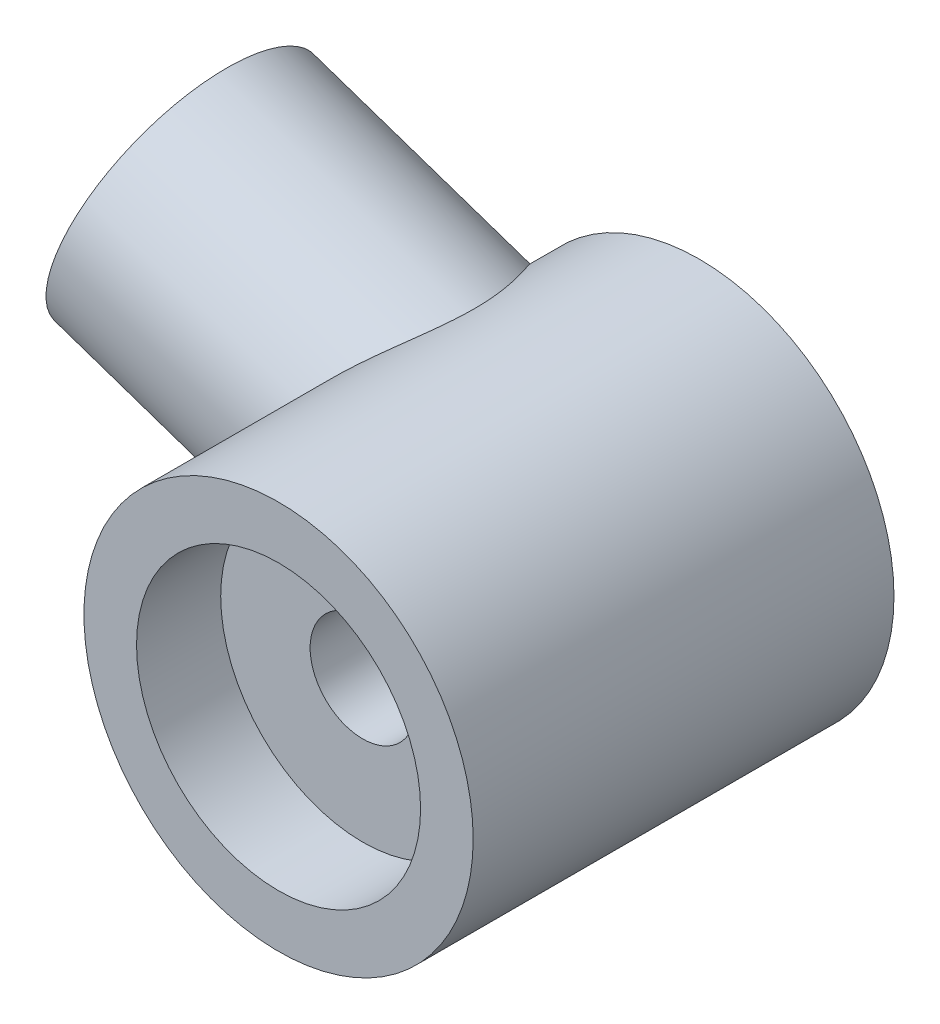
ISO-10303-21;
HEADER;
FILE_DESCRIPTION(('STEP AP214'),'2;1');
FILE_NAME('part.step','',(''),(''),'','','');
FILE_SCHEMA(('AUTOMOTIVE_DESIGN { 1 0 10303 214 1 1 1 1 }'));
ENDSEC;
DATA;
#1=APPLICATION_CONTEXT('core data for automotive mechanical design processes');
#2=APPLICATION_PROTOCOL_DEFINITION('international standard','automotive_design',2000,#1);
#3=PRODUCT_CONTEXT('',#1,'mechanical');
#4=PRODUCT('Part','Part','',(#3));
#5=PRODUCT_RELATED_PRODUCT_CATEGORY('part','',(#4));
#6=PRODUCT_DEFINITION_FORMATION('','',#4);
#7=PRODUCT_DEFINITION_CONTEXT('part definition',#1,'design');
#8=PRODUCT_DEFINITION('design','',#6,#7);
#9=PRODUCT_DEFINITION_SHAPE('','',#8);
#10=(LENGTH_UNIT() NAMED_UNIT(*) SI_UNIT(.MILLI.,.METRE.));
#11=(NAMED_UNIT(*) PLANE_ANGLE_UNIT() SI_UNIT($,.RADIAN.));
#12=(NAMED_UNIT(*) SI_UNIT($,.STERADIAN.) SOLID_ANGLE_UNIT());
#13=UNCERTAINTY_MEASURE_WITH_UNIT(LENGTH_MEASURE(1.E-05),#10,'distance_accuracy_value','');
#14=(GEOMETRIC_REPRESENTATION_CONTEXT(3) GLOBAL_UNCERTAINTY_ASSIGNED_CONTEXT((#13)) GLOBAL_UNIT_ASSIGNED_CONTEXT((#10,
#11,#12)) REPRESENTATION_CONTEXT('',''));
#15=CARTESIAN_POINT('',(0.,0.,0.));
#16=DIRECTION('',(0.,0.,1.));
#17=DIRECTION('',(1.,0.,0.));
#18=AXIS2_PLACEMENT_3D('',#15,#16,#17);
#19=CARTESIAN_POINT('',(51.0812570126981,-10.9818900663506,25.));
#20=DIRECTION('',(0.,0.,1.));
#21=DIRECTION('',(1.,0.,0.));
#22=AXIS2_PLACEMENT_3D('',#19,#20,#21);
#23=CYLINDRICAL_SURFACE('',#22,18.5);
#24=CARTESIAN_POINT('',(51.0812570126981,-10.9818900663506,40.));
#25=DIRECTION('',(0.,0.,1.));
#26=DIRECTION('',(1.,0.,0.));
#27=AXIS2_PLACEMENT_3D('',#24,#25,#26);
#28=CIRCLE('',#27,18.5);
#29=CARTESIAN_POINT('',(69.5812570126981,-10.9818900663506,40.));
#30=VERTEX_POINT('',#29);
#31=EDGE_CURVE('E11',#30,#30,#28,.T.);
#32=ORIENTED_EDGE('',*,*,#31,.F.);
#33=EDGE_LOOP('',(#32));
#34=FACE_BOUND('',#33,.T.);
#35=CARTESIAN_POINT('',(51.0812570126981,-10.9818900663506,0.));
#36=DIRECTION('',(0.,0.,-1.));
#37=DIRECTION('',(-1.,0.,0.));
#38=AXIS2_PLACEMENT_3D('',#35,#36,#37);
#39=CIRCLE('',#38,18.5);
#40=CARTESIAN_POINT('',(33.5682457005577,-5.01997470458624,0.));
#41=VERTEX_POINT('',#40);
#42=EDGE_CURVE('E64',#41,#41,#39,.T.);
#43=ORIENTED_EDGE('',*,*,#42,.F.);
#44=CARTESIAN_POINT('',(42.1990035903044,5.24634379135472,12.5));
#45=CARTESIAN_POINT('',(42.1990004703523,5.24634318109895,12.8038051601148));
#46=CARTESIAN_POINT('',(42.1857730097204,5.23912353675234,13.107631072088));
#47=CARTESIAN_POINT('',(42.133441284413,5.21031361647367,13.7123582731616));
#48=CARTESIAN_POINT('',(42.0943339456624,5.1887216333584,14.0132592105174));
#49=CARTESIAN_POINT('',(41.9918043604203,5.13131214730716,14.609956738981));
#50=CARTESIAN_POINT('',(41.928344197281,5.0954724579592,14.9057446149086));
#51=CARTESIAN_POINT('',(41.7795023831543,5.00981739119636,15.4896378095039));
#52=CARTESIAN_POINT('',(41.6941200263972,4.96000156382472,15.7777428804994));
#53=CARTESIAN_POINT('',(41.505192162109,4.84722675183263,16.341792525707));
#54=CARTESIAN_POINT('',(41.401844507353,4.78440964575624,16.6178323212905));
#55=CARTESIAN_POINT('',(41.1790966966357,4.64547209518702,17.160018605195));
#56=CARTESIAN_POINT('',(41.059689084152,4.56934546622535,17.4261604242459));
#57=CARTESIAN_POINT('',(40.8075089757295,4.40390964786538,17.94773864138));
#58=CARTESIAN_POINT('',(40.6747375251603,4.3146014893215,18.2031758746058));
#59=CARTESIAN_POINT('',(40.3983007345399,4.12283565512731,18.7028391918628));
#60=CARTESIAN_POINT('',(40.2546384383659,4.02038164810035,18.9470683780144));
#61=CARTESIAN_POINT('',(39.9347647546439,3.78466874224764,19.4624351998478));
#62=CARTESIAN_POINT('',(39.7570354164152,3.64910574109572,19.7315797825207));
#63=CARTESIAN_POINT('',(39.3929379877913,3.35991126702616,20.2538430568364));
#64=CARTESIAN_POINT('',(39.2065692856179,3.20627851334931,20.506960610547));
#65=CARTESIAN_POINT('',(38.8278162899417,2.88049246383237,20.9967660695289));
#66=CARTESIAN_POINT('',(38.6354258410273,2.70831974674971,21.2334363103187));
#67=CARTESIAN_POINT('',(38.2474508912658,2.34530077887374,21.6892171598095));
#68=CARTESIAN_POINT('',(38.0518661916284,2.15445336216518,21.908326670588));
#69=CARTESIAN_POINT('',(37.6304861286932,1.72364742160668,22.3595712664004));
#70=CARTESIAN_POINT('',(37.4045796754574,1.48062204330665,22.5886935297251));
#71=CARTESIAN_POINT('',(36.955663316049,0.969399767957076,23.020346211576));
#72=CARTESIAN_POINT('',(36.7326538990567,0.701198681161049,23.2228721904412));
#73=CARTESIAN_POINT('',(36.2937420308165,0.140428935847601,23.5986931703859));
#74=CARTESIAN_POINT('',(36.0778294124713,-0.1521025349366,23.7720315996849));
#75=CARTESIAN_POINT('',(35.6567188513685,-0.760813013796165,24.0872602672865));
#76=CARTESIAN_POINT('',(35.4515166948199,-1.07698260106889,24.2291629456639));
#77=CARTESIAN_POINT('',(35.1059919863478,-1.64795667266524,24.4472727621351));
#78=CARTESIAN_POINT('',(34.9624281044301,-1.89795174365488,24.5310116931952));
#79=CARTESIAN_POINT('',(34.6849654883009,-2.4089050083029,24.6786402183588));
#80=CARTESIAN_POINT('',(34.55106484009,-2.66986101463653,24.742533751575));
#81=CARTESIAN_POINT('',(34.2944436951149,-3.20115225754367,24.8496294613466));
#82=CARTESIAN_POINT('',(34.171716514209,-3.47148175129909,24.8928440750902));
#83=CARTESIAN_POINT('',(33.9386192071013,-4.0199401510982,24.9580462979628));
#84=CARTESIAN_POINT('',(33.8282494883836,-4.29806931395598,24.980033207296));
#85=CARTESIAN_POINT('',(33.620734912726,-4.86060007086968,25.002477344692));
#86=CARTESIAN_POINT('',(33.5236123078713,-5.14501130865481,25.0028987813528));
#87=CARTESIAN_POINT('',(33.3435489465844,-5.71750435665996,24.9821156976444));
#88=CARTESIAN_POINT('',(33.2606081376334,-6.00558615328274,24.9609112573632));
#89=CARTESIAN_POINT('',(33.109295621336,-6.58327796022762,24.8971768235056));
#90=CARTESIAN_POINT('',(33.0409274761617,-6.87288832650803,24.8546416242939));
#91=CARTESIAN_POINT('',(32.9188506174996,-7.45139502582299,24.7488335135752));
#92=CARTESIAN_POINT('',(32.8651419598402,-7.74029135613409,24.6855605230934));
#93=CARTESIAN_POINT('',(32.7729551502358,-8.31019905941583,24.5403991003049));
#94=CARTESIAN_POINT('',(32.734223037363,-8.59125927321445,24.4588618743987));
#95=CARTESIAN_POINT('',(32.6701439755172,-9.14894083703371,24.2774927808327));
#96=CARTESIAN_POINT('',(32.644796776859,-9.42556226976306,24.1776612544858));
#97=CARTESIAN_POINT('',(32.6067632161282,-9.97277980646673,23.9607086488563));
#98=CARTESIAN_POINT('',(32.5940757192983,-10.2433764483494,23.843589120271));
#99=CARTESIAN_POINT('',(32.5804598515267,-10.7772971877118,23.5930242719745));
#100=CARTESIAN_POINT('',(32.5795357424608,-11.0406186149067,23.4595730529691));
#101=CARTESIAN_POINT('',(32.5889381217991,-11.5878719497218,23.1614686464702));
#102=CARTESIAN_POINT('',(32.6005419152557,-11.8707901541548,22.9949942380252));
#103=CARTESIAN_POINT('',(32.6355142982015,-12.4246660857671,22.6443124698185));
#104=CARTESIAN_POINT('',(32.6588843826329,-12.6956222883793,22.4601028591525));
#105=CARTESIAN_POINT('',(32.7157722131161,-13.2246140689719,22.0748342075059));
#106=CARTESIAN_POINT('',(32.7493013576305,-13.4826347523425,21.8737564246489));
#107=CARTESIAN_POINT('',(32.8247426203512,-13.9842226638357,21.4559038323097));
#108=CARTESIAN_POINT('',(32.8666530561845,-14.227792779912,21.2391321786138));
#109=CARTESIAN_POINT('',(32.9646162358307,-14.7390059948362,20.7529485339722));
#110=CARTESIAN_POINT('',(33.021861990995,-15.0038322055367,20.4808064612039));
#111=CARTESIAN_POINT('',(33.1421946731552,-15.5104489431421,19.9169687297742));
#112=CARTESIAN_POINT('',(33.2052827596981,-15.7522348777623,19.625269192662));
#113=CARTESIAN_POINT('',(33.3338895266827,-16.210421359651,19.0232265504769));
#114=CARTESIAN_POINT('',(33.3994072409654,-16.4268318581409,18.7128908264484));
#115=CARTESIAN_POINT('',(33.5291889964054,-16.8316832124894,18.0742651151403));
#116=CARTESIAN_POINT('',(33.5934534317942,-17.0201329910775,17.745980901484));
#117=CARTESIAN_POINT('',(33.7020674896346,-17.3248697442034,17.1524335779718));
#118=CARTESIAN_POINT('',(33.747523537697,-17.4476682102908,16.8907064551427));
#119=CARTESIAN_POINT('',(33.8334733552347,-17.6735688507567,16.3581199787276));
#120=CARTESIAN_POINT('',(33.8739683869524,-17.7766760389775,16.087262970536));
#121=CARTESIAN_POINT('',(33.948063895617,-17.9614031197094,15.537813801551));
#122=CARTESIAN_POINT('',(33.9816745044429,-18.043054639594,15.2592337030365));
#123=CARTESIAN_POINT('',(34.0403221676983,-18.1834417443456,14.695433100566));
#124=CARTESIAN_POINT('',(34.0653592996475,-18.2421775364126,14.4102126566755));
#125=CARTESIAN_POINT('',(34.1055773057452,-18.3357281271418,13.8327589435191));
#126=CARTESIAN_POINT('',(34.1206763201503,-18.3703443877491,13.5404874951778));
#127=CARTESIAN_POINT('',(34.1397368400603,-18.4139471059357,12.9536650568986));
#128=CARTESIAN_POINT('',(34.1436985481368,-18.4229340296756,12.6591141085192));
#129=CARTESIAN_POINT('',(34.1402259731571,-18.4150241714813,12.0704146456311));
#130=CARTESIAN_POINT('',(34.1327910199503,-18.3981258674347,11.7762661558058));
#131=CARTESIAN_POINT('',(34.1070065775937,-18.3389176229889,11.1910465767764));
#132=CARTESIAN_POINT('',(34.0886572923969,-18.2966081574406,10.8999754301703));
#133=CARTESIAN_POINT('',(34.0447310202563,-18.1936531078051,10.3548525184684));
#134=CARTESIAN_POINT('',(34.0201657540057,-18.1355233043021,10.1002378001727));
#135=CARTESIAN_POINT('',(33.9644060803802,-18.0010571022619,9.59657115137172));
#136=CARTESIAN_POINT('',(33.9332092502887,-17.9247140486079,9.34752129072921));
#137=CARTESIAN_POINT('',(33.8315561766194,-17.6700331360671,8.61012068469348));
#138=CARTESIAN_POINT('',(33.7530367332774,-17.4660421750308,8.13151201990254));
#139=CARTESIAN_POINT('',(33.6086315087869,-17.0637957911613,7.33375551004699));
#140=CARTESIAN_POINT('',(33.5452061054282,-16.8793780704197,7.00693918067331));
#141=CARTESIAN_POINT('',(33.4167755331285,-16.4827580702371,6.370731092665));
#142=CARTESIAN_POINT('',(33.3517697904605,-16.270545573693,6.06134580162289));
#143=CARTESIAN_POINT('',(33.2237458140137,-15.8206993725207,5.46050075813813));
#144=CARTESIAN_POINT('',(33.1607308790668,-15.5830260740534,5.16907006839446));
#145=CARTESIAN_POINT('',(33.0401298854157,-15.0847470935712,4.60538322365396));
#146=CARTESIAN_POINT('',(32.9825432402237,-14.8241438948637,4.33312499801551));
#147=CARTESIAN_POINT('',(32.8751473235017,-14.2782500518727,3.80513122231914));
#148=CARTESIAN_POINT('',(32.8254524520651,-13.9926756879782,3.54966556169267));
#149=CARTESIAN_POINT('',(32.7377647652012,-13.4017096736669,3.06049330293056));
#150=CARTESIAN_POINT('',(32.6997728129821,-13.096316563428,2.82678831075031));
#151=CARTESIAN_POINT('',(32.638349217535,-12.4680405216275,2.38300391127277));
#152=CARTESIAN_POINT('',(32.6148973809386,-12.1451825264206,2.17289207153857));
#153=CARTESIAN_POINT('',(32.5851025813103,-11.4836964498867,1.77779785385484));
#154=CARTESIAN_POINT('',(32.5787558939063,-11.1450718178294,1.59281001388808));
#155=CARTESIAN_POINT('',(32.5849454999201,-10.516008917238,1.28057839649931));
#156=CARTESIAN_POINT('',(32.5943210681591,-10.227725258587,1.14891764472228));
#157=CARTESIAN_POINT('',(32.6273966259348,-9.64379140477211,0.905232925608279));
#158=CARTESIAN_POINT('',(32.6510940041894,-9.34814256191469,0.7932053833691));
#159=CARTESIAN_POINT('',(32.7137564680703,-8.75144851032243,0.590057417835616));
#160=CARTESIAN_POINT('',(32.7527149862243,-8.45040567594247,0.498928027948622));
#161=CARTESIAN_POINT('',(32.8465823557639,-7.84493677410966,0.338673630734353));
#162=CARTESIAN_POINT('',(32.9014914152478,-7.54051066256684,0.269548910514925));
#163=CARTESIAN_POINT('',(33.0279013448519,-6.92921012733255,0.154015461145853));
#164=CARTESIAN_POINT('',(33.0994798309049,-6.62233094398195,0.107716256165114));
#165=CARTESIAN_POINT('',(33.2590291842108,-6.01014567721205,0.0390475707194369));
#166=CARTESIAN_POINT('',(33.3470000838172,-5.70483959689879,0.016678137485059));
#167=CARTESIAN_POINT('',(33.5388341596858,-5.09848070765212,-0.00376504204457373));
#168=CARTESIAN_POINT('',(33.6426951001003,-4.79742730683462,-0.00184220334391326));
#169=CARTESIAN_POINT('',(33.8654120463441,-4.20209103163858,0.0262605885857014));
#170=CARTESIAN_POINT('',(33.9842672750466,-3.90780780730797,0.0524392851232159));
#171=CARTESIAN_POINT('',(34.2258186852923,-3.35110116081223,0.125630029018594));
#172=CARTESIAN_POINT('',(34.3474816544595,-3.08798973349832,0.170846134761401));
#173=CARTESIAN_POINT('',(34.6012270409609,-2.57109366779379,0.280912905419104));
#174=CARTESIAN_POINT('',(34.7333088078289,-2.3173084485974,0.345762345302456));
#175=CARTESIAN_POINT('',(35.0065343139243,-1.82035568847913,0.494315599856238));
#176=CARTESIAN_POINT('',(35.1476786893229,-1.57718889496001,0.578020739183565));
#177=CARTESIAN_POINT('',(35.4375631378103,-1.10250763186479,0.763367934358948));
#178=CARTESIAN_POINT('',(35.5863036061787,-0.87099376992185,0.865010924319686));
#179=CARTESIAN_POINT('',(35.8978813548455,-0.408484800729073,1.09106144556854));
#180=CARTESIAN_POINT('',(36.0610483686798,-0.178161160167725,1.21638693044586));
#181=CARTESIAN_POINT('',(36.3924154046792,0.268231782884535,1.48471229891561));
#182=CARTESIAN_POINT('',(36.5606171275406,0.484296187867719,1.62771820710502));
#183=CARTESIAN_POINT('',(36.9002990458244,0.901833331418676,1.93030481379832));
#184=CARTESIAN_POINT('',(37.0717800556181,1.10330238433136,2.08988967426881));
#185=CARTESIAN_POINT('',(37.4162554411596,1.49148499353486,2.42459323050319));
#186=CARTESIAN_POINT('',(37.5892498890581,1.67819784204355,2.59971267053));
#187=CARTESIAN_POINT('',(37.9624369895408,2.06532507313629,2.99350589286404));
#188=CARTESIAN_POINT('',(38.1625979076497,2.26322603247583,3.2146850961807));
#189=CARTESIAN_POINT('',(38.5599163931896,2.63944901620823,3.67547986536386));
#190=CARTESIAN_POINT('',(38.7570744743147,2.8177744225323,3.91509223445723));
#191=CARTESIAN_POINT('',(39.1458245023339,3.15535790364634,4.41211181190866));
#192=CARTESIAN_POINT('',(39.3374109477113,3.3145975867546,4.66953581344171));
#193=CARTESIAN_POINT('',(39.7118055270322,3.61410359212099,5.20123576377901));
#194=CARTESIAN_POINT('',(39.8946143300617,3.75437136202086,5.47551042447755));
#195=CARTESIAN_POINT('',(40.2382717523585,4.00886724113461,6.02454126931335));
#196=CARTESIAN_POINT('',(40.3997766407975,4.12411223498631,6.2984147486715));
#197=CARTESIAN_POINT('',(40.7089097344754,4.33802325184628,6.86017720404314));
#198=CARTESIAN_POINT('',(40.8565374170814,4.43668865055641,7.1480667072983));
#199=CARTESIAN_POINT('',(41.1342378043348,4.61728345070081,7.73677220331342));
#200=CARTESIAN_POINT('',(41.2643346824912,4.69923597957822,8.03756962612304));
#201=CARTESIAN_POINT('',(41.503423247375,4.84640209851979,8.65140969868402));
#202=CARTESIAN_POINT('',(41.6124201560857,4.91161983154433,8.96444929553566));
#203=CARTESIAN_POINT('',(41.7872075707666,5.01432478001165,9.54095377158535));
#204=CARTESIAN_POINT('',(41.8572705670028,5.05472335732754,9.80260759827589));
#205=CARTESIAN_POINT('',(41.9790390556458,5.12415091539519,10.331615749277));
#206=CARTESIAN_POINT('',(42.0307486466322,5.15318243472421,10.5989687867172));
#207=CARTESIAN_POINT('',(42.1141570751868,5.19968625310256,11.1375201309299));
#208=CARTESIAN_POINT('',(42.1458759082006,5.21717010337122,11.40871431707));
#209=CARTESIAN_POINT('',(42.1883013716707,5.24049959137687,11.9532666254182));
#210=CARTESIAN_POINT('',(42.1990063977523,5.24634434048536,12.2266249112526));
#211=CARTESIAN_POINT('',(42.1990035903044,5.24634379135472,12.5));
#212=B_SPLINE_CURVE_WITH_KNOTS('',3,(#44,#45,#46,#47,#48,#49,#50,#51,#52,#53,#54,#55,#56,#57,
#58,#59,#60,#61,#62,#63,#64,#65,#66,#67,#68,#69,#70,#71,#72,#73,#74,#75,#76,#77,#78,#79,#80,#81,
#82,#83,#84,#85,#86,#87,#88,#89,#90,#91,#92,#93,#94,#95,#96,#97,#98,#99,#100,#101,#102,#103,
#104,#105,#106,#107,#108,#109,#110,#111,#112,#113,#114,#115,#116,#117,#118,#119,#120,#121,#122,
#123,#124,#125,#126,#127,#128,#129,#130,#131,#132,#133,#134,#135,#136,#137,#138,#139,#140,#141,
#142,#143,#144,#145,#146,#147,#148,#149,#150,#151,#152,#153,#154,#155,#156,#157,#158,#159,#160,
#161,#162,#163,#164,#165,#166,#167,#168,#169,#170,#171,#172,#173,#174,#175,#176,#177,#178,#179,
#180,#181,#182,#183,#184,#185,#186,#187,#188,#189,#190,#191,#192,#193,#194,#195,#196,#197,#198,
#199,#200,#201,#202,#203,#204,#205,#206,#207,#208,#209,#210,#211),.UNSPECIFIED.,.T.,.F.,(4,2,2,
2,2,2,2,2,2,2,2,2,2,2,2,2,2,2,2,2,2,2,2,2,2,2,2,2,2,2,2,2,2,2,2,2,2,2,2,2,2,2,2,2,2,2,2,2,2,2,2,
2,2,2,2,2,2,2,2,2,2,2,2,2,2,2,2,2,2,2,2,2,2,2,2,2,2,2,2,2,2,2,2,4),(0.,0.911085719287614,
1.82227967898802,2.73489813560064,3.64754597701027,4.55071504959763,5.45430491402545,
6.35782415110064,7.26109178846836,8.309692034843,9.3583666494006,10.4081506740928,
11.4580002816919,12.6660561136492,13.874313348144,15.0807566165052,16.2867216026317,
17.1863939337261,18.0858875745814,18.9848395393179,19.8838211380325,20.7842946943072,
21.6847649158317,22.5854549983718,23.4861485110144,24.3708181337871,25.2554712531443,
26.1400450691451,27.0249393571538,28.0093778491176,28.9939414484922,29.97961384457,
30.9650885852795,32.1158947092438,33.2669297290638,34.4175118389859,35.5677259857015,
36.4449349774172,37.3219203133265,38.1976055570948,39.0732828828893,39.9560857355193,
40.8388725311359,41.7217112386854,42.6045334493985,43.3906650544386,44.1770843529063,
45.7499019963944,46.8903697673936,48.0312579466104,49.1739467976735,50.3165120475423,
51.4743684275887,52.6323101907807,53.7886401764276,54.9447183694003,55.8949699236964,
56.8450482717812,57.7947182119311,58.7444005424745,59.6985964476559,60.6527942361451,
61.6068578851396,62.5608721070395,63.4400266619853,64.3191263729517,65.1982878619959,
66.0774951468477,67.0030771117701,67.9289753421463,68.8551065735129,69.7812821998871,
70.8541439978367,71.9268201522887,73.0005218036455,74.0741414804927,75.0877895626726,
76.1014758048234,77.1137496338544,78.1257726163614,78.9465440600121,79.7671320980907,
80.586898047629,81.406726582709),.UNSPECIFIED.);
#213=EDGE_CURVE('E57',#41,#41,#212,.T.);
#214=ORIENTED_EDGE('',*,*,#213,.T.);
#215=EDGE_LOOP('',(#43,#214));
#216=FACE_BOUND('',#215,.T.);
#217=ADVANCED_FACE('F45',(#34,#216),#23,.T.);
#218=CARTESIAN_POINT('',(51.0812570126981,-10.9818900663506,25.));
#219=DIRECTION('',(0.,0.,1.));
#220=DIRECTION('',(1.,0.,0.));
#221=AXIS2_PLACEMENT_3D('',#218,#219,#220);
#222=CYLINDRICAL_SURFACE('',#221,5.);
#223=CARTESIAN_POINT('',(51.0812570126981,-10.9818900663506,32.));
#224=DIRECTION('',(0.,0.,1.));
#225=DIRECTION('',(1.,0.,0.));
#226=AXIS2_PLACEMENT_3D('',#223,#224,#225);
#227=CIRCLE('',#226,5.);
#228=CARTESIAN_POINT('',(56.0812570126981,-10.9818900663506,32.));
#229=VERTEX_POINT('',#228);
#230=EDGE_CURVE('E219',#229,#229,#227,.T.);
#231=ORIENTED_EDGE('',*,*,#230,.T.);
#232=EDGE_LOOP('',(#231));
#233=FACE_BOUND('',#232,.T.);
#234=CARTESIAN_POINT('',(51.0812570126981,-10.9818900663506,5.));
#235=DIRECTION('',(0.,0.,1.));
#236=DIRECTION('',(1.,0.,0.));
#237=AXIS2_PLACEMENT_3D('',#234,#235,#236);
#238=CIRCLE('',#237,5.00000000000001);
#239=CARTESIAN_POINT('',(56.0812570126981,-10.9818900663506,5.));
#240=VERTEX_POINT('',#239);
#241=EDGE_CURVE('E195',#240,#240,#238,.T.);
#242=ORIENTED_EDGE('',*,*,#241,.F.);
#243=EDGE_LOOP('',(#242));
#244=FACE_BOUND('',#243,.T.);
#245=ADVANCED_FACE('F100',(#233,#244),#222,.F.);
#246=CARTESIAN_POINT('',(-64.4475259166011,-26.42616,40.));
#247=DIRECTION('',(0.,0.,1.));
#248=DIRECTION('',(1.,0.,0.));
#249=AXIS2_PLACEMENT_3D('',#246,#247,#248);
#250=PLANE('',#249);
#251=CARTESIAN_POINT('',(51.0812570126981,-10.9818900663506,40.));
#252=DIRECTION('',(0.,0.,1.));
#253=DIRECTION('',(1.,0.,0.));
#254=AXIS2_PLACEMENT_3D('',#251,#252,#253);
#255=CIRCLE('',#254,13.5);
#256=CARTESIAN_POINT('',(64.5812570126981,-10.9818900663506,40.));
#257=VERTEX_POINT('',#256);
#258=EDGE_CURVE('E69',#257,#257,#255,.T.);
#259=ORIENTED_EDGE('',*,*,#258,.F.);
#260=EDGE_LOOP('',(#259));
#261=FACE_BOUND('',#260,.T.);
#262=ORIENTED_EDGE('',*,*,#31,.T.);
#263=EDGE_LOOP('',(#262));
#264=FACE_BOUND('',#263,.T.);
#265=ADVANCED_FACE('F98',(#261,#264),#250,.T.);
#266=CARTESIAN_POINT('',(51.0812570126981,-10.9818900663506,32.));
#267=DIRECTION('',(0.,0.,1.));
#268=DIRECTION('',(1.,0.,0.));
#269=AXIS2_PLACEMENT_3D('',#266,#267,#268);
#270=CYLINDRICAL_SURFACE('',#269,13.5);
#271=CARTESIAN_POINT('',(51.0812570126981,-10.9818900663506,32.));
#272=DIRECTION('',(0.,0.,1.));
#273=DIRECTION('',(1.,0.,0.));
#274=AXIS2_PLACEMENT_3D('',#271,#272,#273);
#275=CIRCLE('',#274,13.5);
#276=CARTESIAN_POINT('',(64.5812570126981,-10.9818900663506,32.));
#277=VERTEX_POINT('',#276);
#278=EDGE_CURVE('E53',#277,#277,#275,.T.);
#279=ORIENTED_EDGE('',*,*,#278,.F.);
#280=EDGE_LOOP('',(#279));
#281=FACE_BOUND('',#280,.T.);
#282=ORIENTED_EDGE('',*,*,#258,.T.);
#283=EDGE_LOOP('',(#282));
#284=FACE_BOUND('',#283,.T.);
#285=ADVANCED_FACE('F94',(#281,#284),#270,.F.);
#286=CARTESIAN_POINT('',(-64.4475259166011,-26.42616,32.));
#287=DIRECTION('',(0.,0.,1.));
#288=DIRECTION('',(1.,0.,0.));
#289=AXIS2_PLACEMENT_3D('',#286,#287,#288);
#290=PLANE('',#289);
#291=ORIENTED_EDGE('',*,*,#230,.F.);
#292=EDGE_LOOP('',(#291));
#293=FACE_BOUND('',#292,.T.);
#294=ORIENTED_EDGE('',*,*,#278,.T.);
#295=EDGE_LOOP('',(#294));
#296=FACE_BOUND('',#295,.T.);
#297=ADVANCED_FACE('F90',(#293,#296),#290,.T.);
#298=CARTESIAN_POINT('',(51.0812570126981,-10.9818900663506,0.));
#299=DIRECTION('',(0.,0.,-1.));
#300=DIRECTION('',(-1.,0.,0.));
#301=AXIS2_PLACEMENT_3D('',#298,#299,#300);
#302=PLANE('',#301);
#303=CARTESIAN_POINT('',(51.0812570126981,-10.9818900663506,0.));
#304=DIRECTION('',(0.,0.,-1.));
#305=DIRECTION('',(-1.,0.,0.));
#306=AXIS2_PLACEMENT_3D('',#303,#304,#305);
#307=CIRCLE('',#306,15.);
#308=CARTESIAN_POINT('',(36.0812570126981,-10.9818900663506,0.));
#309=VERTEX_POINT('',#308);
#310=EDGE_CURVE('E191',#309,#309,#307,.T.);
#311=ORIENTED_EDGE('',*,*,#310,.F.);
#312=EDGE_LOOP('',(#311));
#313=FACE_BOUND('',#312,.T.);
#314=ORIENTED_EDGE('',*,*,#42,.T.);
#315=EDGE_LOOP('',(#314));
#316=FACE_BOUND('',#315,.T.);
#317=ADVANCED_FACE('F87',(#313,#316),#302,.T.);
#318=CARTESIAN_POINT('',(14.6039961567087,1.43598245004827,12.5));
#319=DIRECTION('',(-0.946649260115697,0.322265695230509,0.));
#320=DIRECTION('',(-0.322265695230509,-0.946649260115697,0.));
#321=AXIS2_PLACEMENT_3D('',#318,#319,#320);
#322=PLANE('',#321);
#323=CARTESIAN_POINT('',(14.6039961567087,1.43598245004827,12.5));
#324=DIRECTION('',(-0.946649260115697,0.322265695230509,0.));
#325=DIRECTION('',(-0.322265695230509,-0.946649260115697,0.));
#326=AXIS2_PLACEMENT_3D('',#323,#324,#325);
#327=CIRCLE('',#326,12.5);
#328=CARTESIAN_POINT('',(10.5756749663273,-10.3971333013979,12.5));
#329=VERTEX_POINT('',#328);
#330=EDGE_CURVE('E65',#329,#329,#327,.T.);
#331=ORIENTED_EDGE('',*,*,#330,.T.);
#332=EDGE_LOOP('',(#331));
#333=FACE_BOUND('',#332,.T.);
#334=CARTESIAN_POINT('',(14.6039961567087,1.43598245004827,12.5));
#335=DIRECTION('',(-0.946649260115697,0.322265695230509,0.));
#336=DIRECTION('',(-0.322265695230509,-0.946649260115697,0.));
#337=AXIS2_PLACEMENT_3D('',#334,#335,#336);
#338=CIRCLE('',#337,7.5);
#339=CARTESIAN_POINT('',(12.1870034424798,-5.66388700081946,12.5));
#340=VERTEX_POINT('',#339);
#341=EDGE_CURVE('E72',#340,#340,#338,.T.);
#342=ORIENTED_EDGE('',*,*,#341,.F.);
#343=EDGE_LOOP('',(#342));
#344=FACE_BOUND('',#343,.T.);
#345=ADVANCED_FACE('F85',(#333,#344),#322,.T.);
#346=CARTESIAN_POINT('',(14.6039961567087,1.43598245004827,12.5));
#347=DIRECTION('',(0.946649260115697,-0.322265695230509,0.));
#348=DIRECTION('',(0.322265695230509,0.946649260115697,0.));
#349=AXIS2_PLACEMENT_3D('',#346,#347,#348);
#350=CYLINDRICAL_SURFACE('',#349,12.5);
#351=ORIENTED_EDGE('',*,*,#213,.F.);
#352=EDGE_LOOP('',(#351));
#353=FACE_BOUND('',#352,.T.);
#354=ORIENTED_EDGE('',*,*,#330,.F.);
#355=EDGE_LOOP('',(#354));
#356=FACE_BOUND('',#355,.T.);
#357=ADVANCED_FACE('F58',(#353,#356),#350,.T.);
#358=CARTESIAN_POINT('',(14.6039961567087,1.43598245004827,12.5));
#359=DIRECTION('',(0.946649260115697,-0.322265695230509,0.));
#360=DIRECTION('',(0.322265695230509,0.946649260115697,0.));
#361=AXIS2_PLACEMENT_3D('',#358,#359,#360);
#362=CYLINDRICAL_SURFACE('',#361,7.5);
#363=ORIENTED_EDGE('',*,*,#341,.T.);
#364=EDGE_LOOP('',(#363));
#365=FACE_BOUND('',#364,.T.);
#366=CARTESIAN_POINT('',(33.5369813590226,-5.00933145456191,12.5));
#367=DIRECTION('',(-0.946649260115697,0.322265695230509,0.));
#368=DIRECTION('',(-0.322265695230509,-0.946649260115697,0.));
#369=AXIS2_PLACEMENT_3D('',#366,#367,#368);
#370=CIRCLE('',#369,7.5);
#371=CARTESIAN_POINT('',(31.1199886447938,-12.1092009054296,12.5));
#372=VERTEX_POINT('',#371);
#373=EDGE_CURVE('E201',#372,#372,#370,.T.);
#374=ORIENTED_EDGE('',*,*,#373,.F.);
#375=EDGE_LOOP('',(#374));
#376=FACE_BOUND('',#375,.T.);
#377=ADVANCED_FACE('F84',(#365,#376),#362,.F.);
#378=CARTESIAN_POINT('',(33.5369813590226,-5.00933145456191,12.5));
#379=DIRECTION('',(0.946649260115697,-0.322265695230509,0.));
#380=DIRECTION('',(0.322265695230509,0.946649260115697,0.));
#381=AXIS2_PLACEMENT_3D('',#378,#379,#380);
#382=PLANE('',#381);
#383=ORIENTED_EDGE('',*,*,#373,.T.);
#384=EDGE_LOOP('',(#383));
#385=FACE_BOUND('',#384,.T.);
#386=ADVANCED_FACE('F160',(#385),#382,.F.);
#387=CARTESIAN_POINT('',(51.0812570126981,-10.9818900663506,5.));
#388=DIRECTION('',(0.,0.,-1.));
#389=DIRECTION('',(-1.,0.,0.));
#390=AXIS2_PLACEMENT_3D('',#387,#388,#389);
#391=PLANE('',#390);
#392=CARTESIAN_POINT('',(51.0812570126981,-10.9818900663506,5.));
#393=DIRECTION('',(0.,0.,-1.));
#394=DIRECTION('',(-1.,0.,0.));
#395=AXIS2_PLACEMENT_3D('',#392,#393,#394);
#396=CIRCLE('',#395,15.);
#397=CARTESIAN_POINT('',(36.0812570126981,-10.9818900663506,5.));
#398=VERTEX_POINT('',#397);
#399=EDGE_CURVE('E188',#398,#398,#396,.T.);
#400=ORIENTED_EDGE('',*,*,#399,.T.);
#401=EDGE_LOOP('',(#400));
#402=FACE_BOUND('',#401,.T.);
#403=ORIENTED_EDGE('',*,*,#241,.T.);
#404=EDGE_LOOP('',(#403));
#405=FACE_BOUND('',#404,.T.);
#406=ADVANCED_FACE('F167',(#402,#405),#391,.T.);
#407=CARTESIAN_POINT('',(51.0812570126981,-10.9818900663506,5.));
#408=DIRECTION('',(0.,0.,-1.));
#409=DIRECTION('',(-1.,0.,0.));
#410=AXIS2_PLACEMENT_3D('',#407,#408,#409);
#411=CYLINDRICAL_SURFACE('',#410,15.);
#412=ORIENTED_EDGE('',*,*,#399,.F.);
#413=EDGE_LOOP('',(#412));
#414=FACE_BOUND('',#413,.T.);
#415=ORIENTED_EDGE('',*,*,#310,.T.);
#416=EDGE_LOOP('',(#415));
#417=FACE_BOUND('',#416,.T.);
#418=ADVANCED_FACE('F175',(#414,#417),#411,.F.);
#419=CLOSED_SHELL('',(#217,#245,#265,#285,#297,#317,#345,#357,#377,#386,#406,#418));
#420=MANIFOLD_SOLID_BREP('B2',#419);
#421=ADVANCED_BREP_SHAPE_REPRESENTATION('',(#18,#420),#14);
#422=SHAPE_DEFINITION_REPRESENTATION(#9,#421);
ENDSEC;
END-ISO-10303-21;
